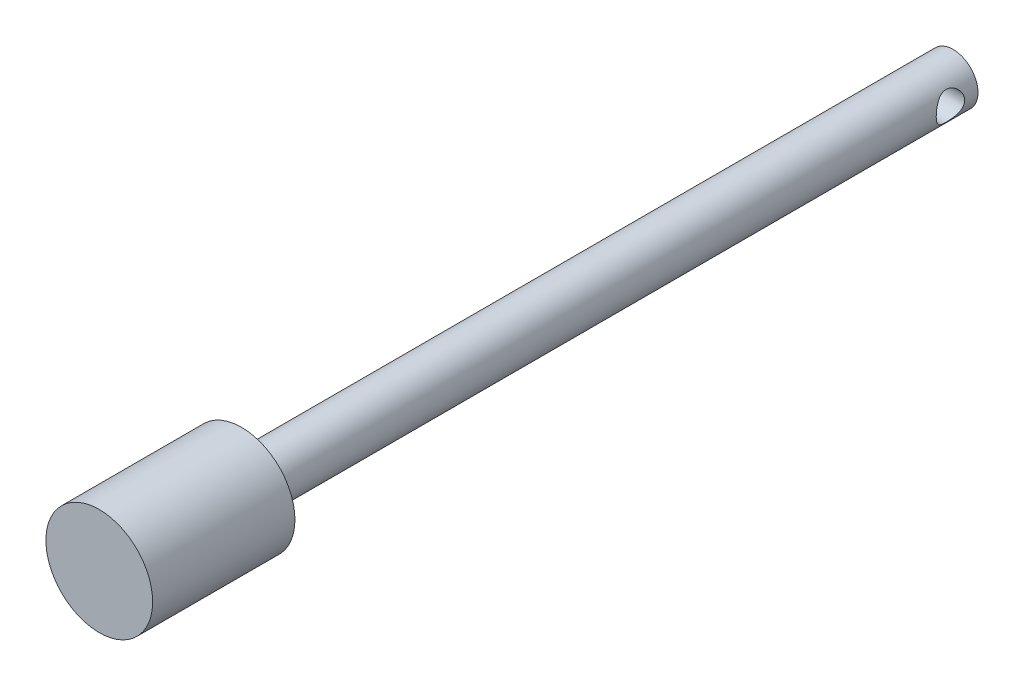
ISO-10303-21;
HEADER;
FILE_DESCRIPTION(('STEP AP214'),'2;1');
FILE_NAME('part.step','',(''),(''),'','','');
FILE_SCHEMA(('AUTOMOTIVE_DESIGN { 1 0 10303 214 1 1 1 1 }'));
ENDSEC;
DATA;
#1=APPLICATION_CONTEXT('core data for automotive mechanical design processes');
#2=APPLICATION_PROTOCOL_DEFINITION('international standard','automotive_design',2000,#1);
#3=PRODUCT_CONTEXT('',#1,'mechanical');
#4=PRODUCT('Part','Part','',(#3));
#5=PRODUCT_RELATED_PRODUCT_CATEGORY('part','',(#4));
#6=PRODUCT_DEFINITION_FORMATION('','',#4);
#7=PRODUCT_DEFINITION_CONTEXT('part definition',#1,'design');
#8=PRODUCT_DEFINITION('design','',#6,#7);
#9=PRODUCT_DEFINITION_SHAPE('','',#8);
#10=(LENGTH_UNIT() NAMED_UNIT(*) SI_UNIT(.MILLI.,.METRE.));
#11=(NAMED_UNIT(*) PLANE_ANGLE_UNIT() SI_UNIT($,.RADIAN.));
#12=(NAMED_UNIT(*) SI_UNIT($,.STERADIAN.) SOLID_ANGLE_UNIT());
#13=UNCERTAINTY_MEASURE_WITH_UNIT(LENGTH_MEASURE(1.E-05),#10,'distance_accuracy_value','');
#14=(GEOMETRIC_REPRESENTATION_CONTEXT(3) GLOBAL_UNCERTAINTY_ASSIGNED_CONTEXT((#13)) GLOBAL_UNIT_ASSIGNED_CONTEXT((#10,
#11,#12)) REPRESENTATION_CONTEXT('',''));
#15=CARTESIAN_POINT('',(0.,0.,0.));
#16=DIRECTION('',(0.,0.,1.));
#17=DIRECTION('',(1.,0.,0.));
#18=AXIS2_PLACEMENT_3D('',#15,#16,#17);
#19=CARTESIAN_POINT('',(0.,0.,100.));
#20=DIRECTION('',(0.,0.,-1.));
#21=DIRECTION('',(-1.,0.,0.));
#22=AXIS2_PLACEMENT_3D('',#19,#20,#21);
#23=CYLINDRICAL_SURFACE('',#22,3.5);
#24=CARTESIAN_POINT('',(-3.5,0.,5.8686947105717));
#25=CARTESIAN_POINT('',(-3.49999553497163,-0.103121073276095,5.86868973782384));
#26=CARTESIAN_POINT('',(-3.49539218804252,-0.206418292241573,5.86066416425724));
#27=CARTESIAN_POINT('',(-3.47741964792396,-0.409938220573779,5.82895309286713));
#28=CARTESIAN_POINT('',(-3.46402785992758,-0.510152306170788,5.80522722877126));
#29=CARTESIAN_POINT('',(-3.42984640883029,-0.704136692781992,5.74339591263725));
#30=CARTESIAN_POINT('',(-3.40909195395481,-0.797935169936749,5.70535884512178));
#31=CARTESIAN_POINT('',(-3.36199330055898,-0.977566018148809,5.61638484487474));
#32=CARTESIAN_POINT('',(-3.33565065986803,-1.06340059975113,5.56545150649715));
#33=CARTESIAN_POINT('',(-3.27741428654611,-1.23168334606477,5.44800891311882));
#34=CARTESIAN_POINT('',(-3.24525701136939,-1.31343890348909,5.38064023747177));
#35=CARTESIAN_POINT('',(-3.17964476042357,-1.46516457042854,5.23413736870798));
#36=CARTESIAN_POINT('',(-3.1461882973923,-1.53512065191323,5.15498937894804));
#37=CARTESIAN_POINT('',(-3.07747838735578,-1.66894420512512,4.97699829134196));
#38=CARTESIAN_POINT('',(-3.04242478885631,-1.73132377325174,4.8769495827214));
#39=CARTESIAN_POINT('',(-2.9791301999857,-1.83811251873574,4.66574443847618));
#40=CARTESIAN_POINT('',(-2.9508789226201,-1.88254890095162,4.55460513956239));
#41=CARTESIAN_POINT('',(-2.9109223878371,-1.94359344806483,4.34954954621952));
#42=CARTESIAN_POINT('',(-2.89693925602986,-1.96418339921187,4.25726319639678));
#43=CARTESIAN_POINT('',(-2.87781339076579,-1.99210676207498,4.06984497487836));
#44=CARTESIAN_POINT('',(-2.87266118113285,-1.99945438414142,3.97471626493471));
#45=CARTESIAN_POINT('',(-2.87194187276705,-2.00048758468052,3.78422002526297));
#46=CARTESIAN_POINT('',(-2.87638786414303,-1.99415450528781,3.68885234678517));
#47=CARTESIAN_POINT('',(-2.89422946937727,-1.96816496378146,3.50079220538497));
#48=CARTESIAN_POINT('',(-2.90763124084925,-1.94849933463808,3.40810162889877));
#49=CARTESIAN_POINT('',(-2.94153701353578,-1.8969175277205,3.22802978025227));
#50=CARTESIAN_POINT('',(-2.9620133688412,-1.86504898450024,3.14062937507269));
#51=CARTESIAN_POINT('',(-3.00785886649625,-1.79016995537344,2.97214485789398));
#52=CARTESIAN_POINT('',(-3.03322987990245,-1.74715520649774,2.89106317801652));
#53=CARTESIAN_POINT('',(-3.09092813712121,-1.64323768381765,2.723721815202));
#54=CARTESIAN_POINT('',(-3.12371858601076,-1.5805729697491,2.63871456884358));
#55=CARTESIAN_POINT('',(-3.18971935679179,-1.44275323922578,2.47961039107028));
#56=CARTESIAN_POINT('',(-3.22293001410095,-1.36758757586109,2.40552286217976));
#57=CARTESIAN_POINT('',(-3.29050445602272,-1.19664071603844,2.26187050915834));
#58=CARTESIAN_POINT('',(-3.32456879734035,-1.09948658535069,2.19378175945374));
#59=CARTESIAN_POINT('',(-3.38586602556589,-0.893015490655641,2.07518791911657));
#60=CARTESIAN_POINT('',(-3.41310321475137,-0.78370624947713,2.0246717469203));
#61=CARTESIAN_POINT('',(-3.45598032097163,-0.563793778179163,1.94651078634578));
#62=CARTESIAN_POINT('',(-3.47229170031822,-0.453802193453642,1.91752649995651));
#63=CARTESIAN_POINT('',(-3.49427902499676,-0.229493069556971,1.87865655169293));
#64=CARTESIAN_POINT('',(-3.49996545850225,-0.115179910205488,1.8687520553383));
#65=CARTESIAN_POINT('',(-3.50003013582766,0.0995234593134498,1.86864469943785));
#66=CARTESIAN_POINT('',(-3.49569611836472,0.199920938989518,1.87619824438744));
#67=CARTESIAN_POINT('',(-3.47874174583056,0.397754958971086,1.90609528396684));
#68=CARTESIAN_POINT('',(-3.46612124870397,0.495191448486281,1.92843903214561));
#69=CARTESIAN_POINT('',(-3.43391644887745,0.683570804723379,1.98657934903879));
#70=CARTESIAN_POINT('',(-3.41440488141579,0.774570013012144,2.02223562051267));
#71=CARTESIAN_POINT('',(-3.36999496877882,0.949355356164687,2.10571044661883));
#72=CARTESIAN_POINT('',(-3.34509532684397,1.03313974782513,2.15353192956627));
#73=CARTESIAN_POINT('',(-3.28897467991617,1.20050997117732,2.26558855142958));
#74=CARTESIAN_POINT('',(-3.25736546620182,1.28316737085611,2.3310140487344));
#75=CARTESIAN_POINT('',(-3.19250590835506,1.43697220197864,2.47365637169451));
#76=CARTESIAN_POINT('',(-3.15925371640031,1.50810627029584,2.55088668811266));
#77=CARTESIAN_POINT('',(-3.09042173562361,1.64492727997191,2.72509723438047));
#78=CARTESIAN_POINT('',(-3.05499597284182,1.70912186715335,2.82331950916391));
#79=CARTESIAN_POINT('',(-2.99031347421968,1.8199337629672,3.03104934198709));
#80=CARTESIAN_POINT('',(-2.96104856289278,1.86657443137412,3.14054165346917));
#81=CARTESIAN_POINT('',(-2.91851233429598,1.93222109228879,3.34392997458041));
#82=CARTESIAN_POINT('',(-2.90316105554951,1.95499953445203,3.43617120160349));
#83=CARTESIAN_POINT('',(-2.88119032331328,1.98724336712396,3.62392880291497));
#84=CARTESIAN_POINT('',(-2.87456093476639,1.99672390601702,3.71944132336748));
#85=CARTESIAN_POINT('',(-2.87099312033822,2.00185191685029,3.91121748043863));
#86=CARTESIAN_POINT('',(-2.87407420528574,1.99747153858607,4.00748224111748));
#87=CARTESIAN_POINT('',(-2.8895014010665,1.97508383758896,4.19767186126407));
#88=CARTESIAN_POINT('',(-2.90185337180125,1.95706789608755,4.29159520196576));
#89=CARTESIAN_POINT('',(-2.93383807739165,1.90877044170586,4.47307034360527));
#90=CARTESIAN_POINT('',(-2.95334114102881,1.87870654392502,4.56070426882089));
#91=CARTESIAN_POINT('',(-2.99749553285303,1.8074218972167,4.7298938063153));
#92=CARTESIAN_POINT('',(-3.02214875873851,1.7661970341072,4.81144716299328));
#93=CARTESIAN_POINT('',(-3.07843523089261,1.66643167949608,4.97953804351482));
#94=CARTESIAN_POINT('',(-3.11055873295866,1.60620233461966,5.06490929103047));
#95=CARTESIAN_POINT('',(-3.17562734730331,1.47338604433882,5.22515234429365));
#96=CARTESIAN_POINT('',(-3.20857315102009,1.40078837818174,5.30001493767579));
#97=CARTESIAN_POINT('',(-3.27641810201075,1.23454792336607,5.44655543369262));
#98=CARTESIAN_POINT('',(-3.31104995544659,1.13941038595581,5.51667709277455));
#99=CARTESIAN_POINT('',(-3.37399623220539,0.93668149876144,5.63975349920288));
#100=CARTESIAN_POINT('',(-3.4023141898287,0.829097167751355,5.69271785817023));
#101=CARTESIAN_POINT('',(-3.44515268687731,0.624382501194148,5.77131185470458));
#102=CARTESIAN_POINT('',(-3.46123111271098,0.528793868969382,5.80012706155393));
#103=CARTESIAN_POINT('',(-3.48544612424225,0.333572465521444,5.84319689365157));
#104=CARTESIAN_POINT('',(-3.49360564902775,0.233952251382029,5.85749358105491));
#105=CARTESIAN_POINT('',(-3.49829363663156,0.111553482810456,5.86570688699354));
#106=CARTESIAN_POINT('',(-3.49893257713488,0.0892655426398943,5.86682624069662));
#107=CARTESIAN_POINT('',(-3.49978626453079,0.0446544907867996,5.86832072995785));
#108=CARTESIAN_POINT('',(-3.50000096692386,0.0223313756604221,5.86869578744472));
#109=CARTESIAN_POINT('',(-3.5,0.,5.8686947105717));
#110=B_SPLINE_CURVE_WITH_KNOTS('',3,(#24,#25,#26,#27,#28,#29,#30,#31,#32,#33,#34,#35,#36,#37,
#38,#39,#40,#41,#42,#43,#44,#45,#46,#47,#48,#49,#50,#51,#52,#53,#54,#55,#56,#57,#58,#59,#60,#61,
#62,#63,#64,#65,#66,#67,#68,#69,#70,#71,#72,#73,#74,#75,#76,#77,#78,#79,#80,#81,#82,#83,#84,#85,
#86,#87,#88,#89,#90,#91,#92,#93,#94,#95,#96,#97,#98,#99,#100,#101,#102,#103,#104,#105,#106,#107,
#108,#109),.UNSPECIFIED.,.T.,.F.,(4,2,2,2,2,2,2,2,2,2,2,2,2,2,2,2,2,2,2,2,2,2,2,2,2,2,2,2,2,2,2,
2,2,2,2,2,2,2,2,2,2,2,4),(0.,0.309268603260588,0.619335457908361,0.9279391304917,
1.23645688582088,1.56726264134176,1.89845895106408,2.2656484043951,2.63227902790326,
2.91779157032785,3.2029975462506,3.48859273422686,3.77438448762791,4.05907183070886,
4.34386821620899,4.67430361887065,5.00502190433097,5.37340568410988,5.74155673192309,
6.08426181113763,6.4266284177419,6.72747548140297,7.028327702629,7.3260949268691,
7.62393389525626,7.95277463151787,8.28199402221959,8.6479313077277,9.01337988790353,
9.30087929443284,9.58805092761004,9.87579992974731,10.1637309643623,10.4466801504154,
10.7297337802306,11.0563737137124,11.3832982298873,11.7509152703937,12.1183260120783,
12.4204193511693,12.7216349655948,12.7886015789519,12.85557521625),.UNSPECIFIED.);
#111=CARTESIAN_POINT('',(-3.5,0.,5.8686947105717));
#112=VERTEX_POINT('',#111);
#113=EDGE_CURVE('E35',#112,#112,#110,.T.);
#114=ORIENTED_EDGE('',*,*,#113,.T.);
#115=EDGE_LOOP('',(#114));
#116=FACE_BOUND('',#115,.T.);
#117=CARTESIAN_POINT('',(3.5,0.,1.8686947105717));
#118=CARTESIAN_POINT('',(3.49999553497163,-0.103121073276093,1.86869968331957));
#119=CARTESIAN_POINT('',(3.49539218804252,-0.206418292241571,1.87672525688617));
#120=CARTESIAN_POINT('',(3.47741964792396,-0.409938220573778,1.90843632827627));
#121=CARTESIAN_POINT('',(3.46402785992758,-0.510152306170786,1.93216219237215));
#122=CARTESIAN_POINT('',(3.42984640883029,-0.70413669278199,1.99399350850616));
#123=CARTESIAN_POINT('',(3.40909195395481,-0.797935169936748,2.03203057602162));
#124=CARTESIAN_POINT('',(3.36199330055898,-0.977566018148807,2.12100457626867));
#125=CARTESIAN_POINT('',(3.33565065986803,-1.06340059975112,2.17193791464626));
#126=CARTESIAN_POINT('',(3.27741428654612,-1.23168334606476,2.28938050802459));
#127=CARTESIAN_POINT('',(3.24525701136939,-1.31343890348909,2.35674918367164));
#128=CARTESIAN_POINT('',(3.17964476042357,-1.46516457042853,2.50325205243543));
#129=CARTESIAN_POINT('',(3.1461882973923,-1.53512065191323,2.58240004219537));
#130=CARTESIAN_POINT('',(3.07747838735578,-1.66894420512512,2.76039112980145));
#131=CARTESIAN_POINT('',(3.04242478885631,-1.73132377325174,2.86043983842201));
#132=CARTESIAN_POINT('',(2.9791301999857,-1.83811251873574,3.07164498266722));
#133=CARTESIAN_POINT('',(2.9508789226201,-1.88254890095162,3.18278428158102));
#134=CARTESIAN_POINT('',(2.9109223878371,-1.94359344806483,3.38783987492389));
#135=CARTESIAN_POINT('',(2.89693925602986,-1.96418339921187,3.48012622474663));
#136=CARTESIAN_POINT('',(2.87781339076579,-1.99210676207498,3.66754444626504));
#137=CARTESIAN_POINT('',(2.87266118113285,-1.99945438414142,3.76267315620869));
#138=CARTESIAN_POINT('',(2.87194187276705,-2.00048758468052,3.95316939588044));
#139=CARTESIAN_POINT('',(2.87638786414303,-1.99415450528781,4.04853707435824));
#140=CARTESIAN_POINT('',(2.89422946937727,-1.96816496378146,4.23659721575844));
#141=CARTESIAN_POINT('',(2.90763124084925,-1.94849933463808,4.32928779224464));
#142=CARTESIAN_POINT('',(2.94153701353578,-1.8969175277205,4.50935964089114));
#143=CARTESIAN_POINT('',(2.9620133688412,-1.86504898450024,4.59676004607072));
#144=CARTESIAN_POINT('',(3.00785886649625,-1.79016995537344,4.76524456324942));
#145=CARTESIAN_POINT('',(3.03322987990244,-1.74715520649774,4.84632624312689));
#146=CARTESIAN_POINT('',(3.09092813712121,-1.64323768381765,5.01366760594141));
#147=CARTESIAN_POINT('',(3.12371858601076,-1.5805729697491,5.09867485229983));
#148=CARTESIAN_POINT('',(3.18971935679179,-1.44275323922578,5.25777903007313));
#149=CARTESIAN_POINT('',(3.22293001410095,-1.36758757586109,5.33186655896365));
#150=CARTESIAN_POINT('',(3.29050445602272,-1.19664071603844,5.47551891198506));
#151=CARTESIAN_POINT('',(3.32456879734035,-1.0994865853507,5.54360766168967));
#152=CARTESIAN_POINT('',(3.38586602556589,-0.893015490655644,5.66220150202684));
#153=CARTESIAN_POINT('',(3.41310321475137,-0.783706249477133,5.71271767422311));
#154=CARTESIAN_POINT('',(3.45598032097163,-0.563793778179166,5.79087863479763));
#155=CARTESIAN_POINT('',(3.47229170031822,-0.453802193453644,5.81986292118689));
#156=CARTESIAN_POINT('',(3.49427902499676,-0.229493069556974,5.85873286945048));
#157=CARTESIAN_POINT('',(3.49996545850225,-0.115179910205491,5.86863736580511));
#158=CARTESIAN_POINT('',(3.50003013582766,0.0995234593134469,5.86874472170556));
#159=CARTESIAN_POINT('',(3.49569611836472,0.199920938989515,5.86119117675597));
#160=CARTESIAN_POINT('',(3.47874174583056,0.397754958971083,5.83129413717657));
#161=CARTESIAN_POINT('',(3.46612124870397,0.495191448486278,5.8089503889978));
#162=CARTESIAN_POINT('',(3.43391644887745,0.683570804723377,5.75081007210462));
#163=CARTESIAN_POINT('',(3.41440488141579,0.774570013012141,5.71515380063074));
#164=CARTESIAN_POINT('',(3.36999496877882,0.949355356164684,5.63167897452458));
#165=CARTESIAN_POINT('',(3.34509532684397,1.03313974782513,5.58385749157714));
#166=CARTESIAN_POINT('',(3.28897467991618,1.20050997117732,5.47180086971383));
#167=CARTESIAN_POINT('',(3.25736546620182,1.28316737085611,5.40637537240901));
#168=CARTESIAN_POINT('',(3.19250590835506,1.43697220197864,5.26373304944891));
#169=CARTESIAN_POINT('',(3.15925371640031,1.50810627029584,5.18650273303075));
#170=CARTESIAN_POINT('',(3.09042173562361,1.64492727997191,5.01229218676294));
#171=CARTESIAN_POINT('',(3.05499597284182,1.70912186715334,4.9140699119795));
#172=CARTESIAN_POINT('',(2.99031347421968,1.8199337629672,4.70634007915632));
#173=CARTESIAN_POINT('',(2.96104856289278,1.86657443137411,4.59684776767424));
#174=CARTESIAN_POINT('',(2.91851233429598,1.93222109228879,4.39345944656301));
#175=CARTESIAN_POINT('',(2.90316105554951,1.95499953445203,4.30121821953992));
#176=CARTESIAN_POINT('',(2.88119032331328,1.98724336712396,4.11346061822845));
#177=CARTESIAN_POINT('',(2.87456093476639,1.99672390601702,4.01794809777594));
#178=CARTESIAN_POINT('',(2.87099312033822,2.00185191685029,3.82617194070478));
#179=CARTESIAN_POINT('',(2.87407420528574,1.99747153858607,3.72990718002593));
#180=CARTESIAN_POINT('',(2.8895014010665,1.97508383758896,3.53971755987935));
#181=CARTESIAN_POINT('',(2.90185337180125,1.95706789608755,3.44579421917765));
#182=CARTESIAN_POINT('',(2.93383807739165,1.90877044170586,3.26431907753815));
#183=CARTESIAN_POINT('',(2.95334114102881,1.87870654392502,3.17668515232252));
#184=CARTESIAN_POINT('',(2.99749553285303,1.80742189721671,3.00749561482812));
#185=CARTESIAN_POINT('',(3.02214875873851,1.76619703410721,2.92594225815013));
#186=CARTESIAN_POINT('',(3.0784352308926,1.66643167949609,2.7578513776286));
#187=CARTESIAN_POINT('',(3.11055873295866,1.60620233461966,2.67248013011294));
#188=CARTESIAN_POINT('',(3.17562734730331,1.47338604433882,2.51223707684976));
#189=CARTESIAN_POINT('',(3.20857315102009,1.40078837818174,2.43737448346762));
#190=CARTESIAN_POINT('',(3.27641810201075,1.23454792336607,2.29083398745079));
#191=CARTESIAN_POINT('',(3.31104995544659,1.13941038595582,2.22071232836886));
#192=CARTESIAN_POINT('',(3.37399623220538,0.936681498761445,2.09763592194053));
#193=CARTESIAN_POINT('',(3.4023141898287,0.82909716775136,2.04467156297318));
#194=CARTESIAN_POINT('',(3.44515268687731,0.624382501194155,1.96607756643883));
#195=CARTESIAN_POINT('',(3.46123111271098,0.528793868969389,1.93726235958948));
#196=CARTESIAN_POINT('',(3.48544612424225,0.333572465521451,1.89419252749185));
#197=CARTESIAN_POINT('',(3.49360564902775,0.233952251382037,1.8798958400885));
#198=CARTESIAN_POINT('',(3.49829363663156,0.111553482810462,1.87168253414987));
#199=CARTESIAN_POINT('',(3.49893257713488,0.0892655426398999,1.87056318044679));
#200=CARTESIAN_POINT('',(3.49978626453079,0.0446544907868036,1.86906869118556));
#201=CARTESIAN_POINT('',(3.50000096692386,0.022331375660425,1.86869363369869));
#202=CARTESIAN_POINT('',(3.5,0.,1.8686947105717));
#203=B_SPLINE_CURVE_WITH_KNOTS('',3,(#117,#118,#119,#120,#121,#122,#123,#124,#125,#126,#127,
#128,#129,#130,#131,#132,#133,#134,#135,#136,#137,#138,#139,#140,#141,#142,#143,#144,#145,#146,
#147,#148,#149,#150,#151,#152,#153,#154,#155,#156,#157,#158,#159,#160,#161,#162,#163,#164,#165,
#166,#167,#168,#169,#170,#171,#172,#173,#174,#175,#176,#177,#178,#179,#180,#181,#182,#183,#184,
#185,#186,#187,#188,#189,#190,#191,#192,#193,#194,#195,#196,#197,#198,#199,#200,#201,#202),
.UNSPECIFIED.,.T.,.F.,(4,2,2,2,2,2,2,2,2,2,2,2,2,2,2,2,2,2,2,2,2,2,2,2,2,2,2,2,2,2,2,2,2,2,2,2,
2,2,2,2,2,2,4),(0.,0.309268603260588,0.61933545790836,0.9279391304917,1.23645688582088,
1.56726264134176,1.89845895106408,2.2656484043951,2.63227902790326,2.91779157032785,
3.2029975462506,3.48859273422686,3.77438448762791,4.05907183070886,4.34386821620899,
4.67430361887065,5.00502190433097,5.37340568410988,5.74155673192309,6.08426181113763,
6.42662841774189,6.72747548140297,7.028327702629,7.32609492686909,7.62393389525626,
7.95277463151787,8.28199402221959,8.6479313077277,9.01337988790353,9.30087929443284,
9.58805092761004,9.87579992974731,10.1637309643623,10.4466801504154,10.7297337802306,
11.0563737137124,11.3832982298872,11.7509152703937,12.1183260120783,12.4204193511693,
12.7216349655948,12.7886015789519,12.85557521625),.UNSPECIFIED.);
#204=CARTESIAN_POINT('',(3.5,0.,1.8686947105717));
#205=VERTEX_POINT('',#204);
#206=EDGE_CURVE('E52',#205,#205,#203,.T.);
#207=ORIENTED_EDGE('',*,*,#206,.T.);
#208=EDGE_LOOP('',(#207));
#209=FACE_BOUND('',#208,.T.);
#210=CARTESIAN_POINT('',(0.,0.,100.));
#211=DIRECTION('',(0.,0.,1.));
#212=DIRECTION('',(1.,0.,0.));
#213=AXIS2_PLACEMENT_3D('',#210,#211,#212);
#214=CIRCLE('',#213,3.5);
#215=CARTESIAN_POINT('',(3.5,0.,100.));
#216=VERTEX_POINT('',#215);
#217=EDGE_CURVE('E10',#216,#216,#214,.T.);
#218=ORIENTED_EDGE('',*,*,#217,.F.);
#219=EDGE_LOOP('',(#218));
#220=FACE_BOUND('',#219,.T.);
#221=CARTESIAN_POINT('',(0.,0.,0.));
#222=DIRECTION('',(0.,0.,1.));
#223=DIRECTION('',(1.,0.,0.));
#224=AXIS2_PLACEMENT_3D('',#221,#222,#223);
#225=CIRCLE('',#224,3.5);
#226=CARTESIAN_POINT('',(3.5,0.,0.));
#227=VERTEX_POINT('',#226);
#228=EDGE_CURVE('E42',#227,#227,#225,.T.);
#229=ORIENTED_EDGE('',*,*,#228,.T.);
#230=EDGE_LOOP('',(#229));
#231=FACE_BOUND('',#230,.T.);
#232=ADVANCED_FACE('F31',(#116,#209,#220,#231),#23,.T.);
#233=CARTESIAN_POINT('',(0.,0.,0.));
#234=DIRECTION('',(0.,0.,1.));
#235=DIRECTION('',(1.,0.,0.));
#236=AXIS2_PLACEMENT_3D('',#233,#234,#235);
#237=PLANE('',#236);
#238=ORIENTED_EDGE('',*,*,#228,.F.);
#239=EDGE_LOOP('',(#238));
#240=FACE_BOUND('',#239,.T.);
#241=ADVANCED_FACE('F71',(#240),#237,.F.);
#242=CARTESIAN_POINT('',(0.,0.,120.));
#243=DIRECTION('',(0.,0.,-1.));
#244=DIRECTION('',(-1.,0.,0.));
#245=AXIS2_PLACEMENT_3D('',#242,#243,#244);
#246=CYLINDRICAL_SURFACE('',#245,7.5);
#247=CARTESIAN_POINT('',(0.,0.,120.));
#248=DIRECTION('',(0.,0.,1.));
#249=DIRECTION('',(1.,0.,0.));
#250=AXIS2_PLACEMENT_3D('',#247,#248,#249);
#251=CIRCLE('',#250,7.5);
#252=CARTESIAN_POINT('',(7.5,0.,120.));
#253=VERTEX_POINT('',#252);
#254=EDGE_CURVE('E47',#253,#253,#251,.T.);
#255=ORIENTED_EDGE('',*,*,#254,.F.);
#256=EDGE_LOOP('',(#255));
#257=FACE_BOUND('',#256,.T.);
#258=CARTESIAN_POINT('',(0.,0.,100.));
#259=DIRECTION('',(0.,0.,1.));
#260=DIRECTION('',(1.,0.,0.));
#261=AXIS2_PLACEMENT_3D('',#258,#259,#260);
#262=CIRCLE('',#261,7.5);
#263=CARTESIAN_POINT('',(7.5,0.,100.));
#264=VERTEX_POINT('',#263);
#265=EDGE_CURVE('E50',#264,#264,#262,.T.);
#266=ORIENTED_EDGE('',*,*,#265,.T.);
#267=EDGE_LOOP('',(#266));
#268=FACE_BOUND('',#267,.T.);
#269=ADVANCED_FACE('F66',(#257,#268),#246,.T.);
#270=CARTESIAN_POINT('',(0.,0.,120.));
#271=DIRECTION('',(0.,0.,1.));
#272=DIRECTION('',(1.,0.,0.));
#273=AXIS2_PLACEMENT_3D('',#270,#271,#272);
#274=PLANE('',#273);
#275=ORIENTED_EDGE('',*,*,#254,.T.);
#276=EDGE_LOOP('',(#275));
#277=FACE_BOUND('',#276,.T.);
#278=ADVANCED_FACE('F62',(#277),#274,.T.);
#279=CARTESIAN_POINT('',(0.,0.,100.));
#280=DIRECTION('',(0.,0.,1.));
#281=DIRECTION('',(1.,0.,0.));
#282=AXIS2_PLACEMENT_3D('',#279,#280,#281);
#283=PLANE('',#282);
#284=ORIENTED_EDGE('',*,*,#217,.T.);
#285=EDGE_LOOP('',(#284));
#286=FACE_BOUND('',#285,.T.);
#287=ORIENTED_EDGE('',*,*,#265,.F.);
#288=EDGE_LOOP('',(#287));
#289=FACE_BOUND('',#288,.T.);
#290=ADVANCED_FACE('F60',(#286,#289),#283,.F.);
#291=CARTESIAN_POINT('',(-7.5,0.,3.8686947105717));
#292=DIRECTION('',(1.,0.,0.));
#293=DIRECTION('',(0.,0.,-1.));
#294=AXIS2_PLACEMENT_3D('',#291,#292,#293);
#295=CYLINDRICAL_SURFACE('',#294,2.);
#296=ORIENTED_EDGE('',*,*,#206,.F.);
#297=EDGE_LOOP('',(#296));
#298=FACE_BOUND('',#297,.T.);
#299=ORIENTED_EDGE('',*,*,#113,.F.);
#300=EDGE_LOOP('',(#299));
#301=FACE_BOUND('',#300,.T.);
#302=ADVANCED_FACE('F56',(#298,#301),#295,.F.);
#303=CLOSED_SHELL('',(#232,#241,#269,#278,#290,#302));
#304=MANIFOLD_SOLID_BREP('B2',#303);
#305=ADVANCED_BREP_SHAPE_REPRESENTATION('',(#18,#304),#14);
#306=SHAPE_DEFINITION_REPRESENTATION(#9,#305);
ENDSEC;
END-ISO-10303-21;
